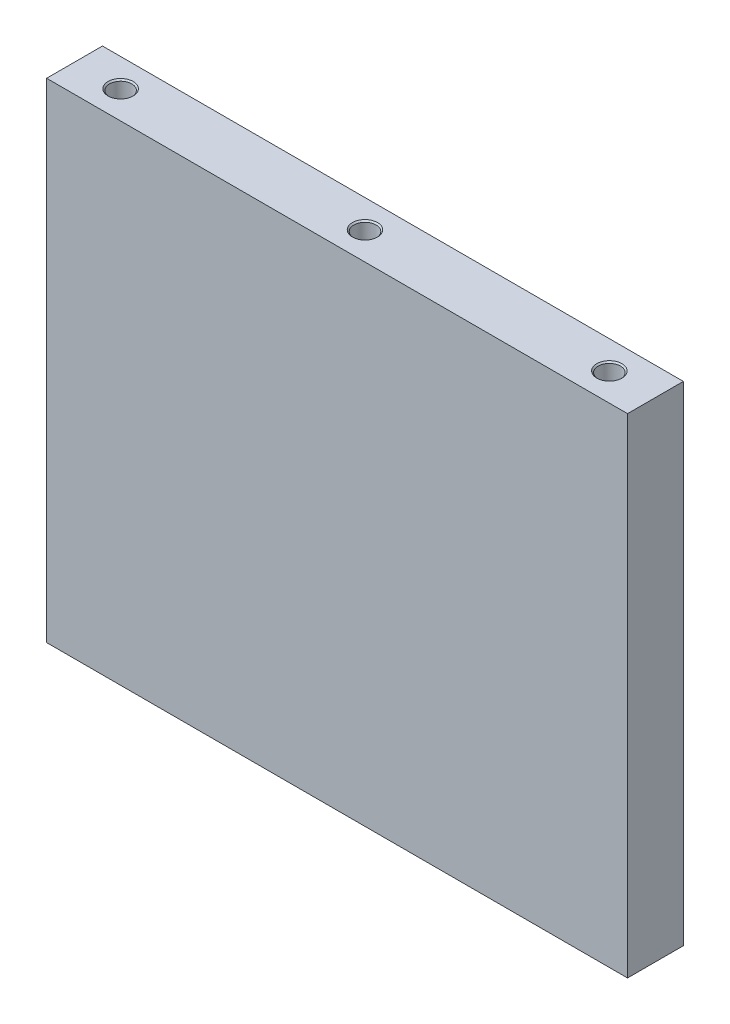
ISO-10303-21;
HEADER;
FILE_DESCRIPTION(('STEP AP214'),'2;1');
FILE_NAME('part.step','',(''),(''),'','','');
FILE_SCHEMA(('AUTOMOTIVE_DESIGN { 1 0 10303 214 1 1 1 1 }'));
ENDSEC;
DATA;
#1=APPLICATION_CONTEXT('core data for automotive mechanical design processes');
#2=APPLICATION_PROTOCOL_DEFINITION('international standard','automotive_design',2000,#1);
#3=PRODUCT_CONTEXT('',#1,'mechanical');
#4=PRODUCT('Part','Part','',(#3));
#5=PRODUCT_RELATED_PRODUCT_CATEGORY('part','',(#4));
#6=PRODUCT_DEFINITION_FORMATION('','',#4);
#7=PRODUCT_DEFINITION_CONTEXT('part definition',#1,'design');
#8=PRODUCT_DEFINITION('design','',#6,#7);
#9=PRODUCT_DEFINITION_SHAPE('','',#8);
#10=(LENGTH_UNIT() NAMED_UNIT(*) SI_UNIT(.MILLI.,.METRE.));
#11=(NAMED_UNIT(*) PLANE_ANGLE_UNIT() SI_UNIT($,.RADIAN.));
#12=(NAMED_UNIT(*) SI_UNIT($,.STERADIAN.) SOLID_ANGLE_UNIT());
#13=UNCERTAINTY_MEASURE_WITH_UNIT(LENGTH_MEASURE(1.E-05),#10,'distance_accuracy_value','');
#14=(GEOMETRIC_REPRESENTATION_CONTEXT(3) GLOBAL_UNCERTAINTY_ASSIGNED_CONTEXT((#13)) GLOBAL_UNIT_ASSIGNED_CONTEXT((#10,
#11,#12)) REPRESENTATION_CONTEXT('',''));
#15=CARTESIAN_POINT('',(0.,0.,0.));
#16=DIRECTION('',(0.,0.,1.));
#17=DIRECTION('',(1.,0.,0.));
#18=AXIS2_PLACEMENT_3D('',#15,#16,#17);
#19=CARTESIAN_POINT('',(-104.,175.,9.99999999999998));
#20=DIRECTION('',(1.,0.,0.));
#21=DIRECTION('',(0.,0.,-1.));
#22=AXIS2_PLACEMENT_3D('',#19,#20,#21);
#23=PLANE('',#22);
#24=DIRECTION('',(0.,0.,1.));
#25=VECTOR('',#24,1.);
#26=CARTESIAN_POINT('',(-104.,0.,9.99999999999998));
#27=LINE('',#26,#25);
#28=CARTESIAN_POINT('',(-104.,0.,-9.99999999999999));
#29=VERTEX_POINT('',#28);
#30=CARTESIAN_POINT('',(-104.,0.,9.99999999999998));
#31=VERTEX_POINT('',#30);
#32=EDGE_CURVE('E111',#29,#31,#27,.T.);
#33=ORIENTED_EDGE('',*,*,#32,.T.);
#34=DIRECTION('',(0.,-1.,0.));
#35=VECTOR('',#34,1.);
#36=CARTESIAN_POINT('',(-104.,175.,9.99999999999998));
#37=LINE('',#36,#35);
#38=CARTESIAN_POINT('',(-104.,175.,9.99999999999998));
#39=VERTEX_POINT('',#38);
#40=EDGE_CURVE('E98',#39,#31,#37,.T.);
#41=ORIENTED_EDGE('',*,*,#40,.F.);
#42=DIRECTION('',(0.,0.,1.));
#43=VECTOR('',#42,1.);
#44=CARTESIAN_POINT('',(-104.,175.,9.99999999999998));
#45=LINE('',#44,#43);
#46=CARTESIAN_POINT('',(-104.,175.,-9.99999999999999));
#47=VERTEX_POINT('',#46);
#48=EDGE_CURVE('E90',#47,#39,#45,.T.);
#49=ORIENTED_EDGE('',*,*,#48,.F.);
#50=DIRECTION('',(0.,-1.,0.));
#51=VECTOR('',#50,1.);
#52=CARTESIAN_POINT('',(-104.,175.,-9.99999999999999));
#53=LINE('',#52,#51);
#54=EDGE_CURVE('E107',#47,#29,#53,.T.);
#55=ORIENTED_EDGE('',*,*,#54,.T.);
#56=EDGE_LOOP('',(#33,#41,#49,#55));
#57=FACE_BOUND('',#56,.T.);
#58=ADVANCED_FACE('F36',(#57),#23,.F.);
#59=CARTESIAN_POINT('',(-104.,175.,9.99999999999998));
#60=DIRECTION('',(0.,0.,-1.));
#61=DIRECTION('',(-1.,0.,0.));
#62=AXIS2_PLACEMENT_3D('',#59,#60,#61);
#63=PLANE('',#62);
#64=DIRECTION('',(1.,0.,0.));
#65=VECTOR('',#64,1.);
#66=CARTESIAN_POINT('',(-104.,0.,9.99999999999998));
#67=LINE('',#66,#65);
#68=CARTESIAN_POINT('',(104.,0.,10.));
#69=VERTEX_POINT('',#68);
#70=EDGE_CURVE('E96',#31,#69,#67,.T.);
#71=ORIENTED_EDGE('',*,*,#70,.T.);
#72=DIRECTION('',(0.,-1.,0.));
#73=VECTOR('',#72,1.);
#74=CARTESIAN_POINT('',(104.,175.,10.));
#75=LINE('',#74,#73);
#76=CARTESIAN_POINT('',(104.,175.,10.));
#77=VERTEX_POINT('',#76);
#78=EDGE_CURVE('E94',#77,#69,#75,.T.);
#79=ORIENTED_EDGE('',*,*,#78,.F.);
#80=DIRECTION('',(1.,0.,0.));
#81=VECTOR('',#80,1.);
#82=CARTESIAN_POINT('',(-104.,175.,9.99999999999998));
#83=LINE('',#82,#81);
#84=EDGE_CURVE('E85',#39,#77,#83,.T.);
#85=ORIENTED_EDGE('',*,*,#84,.F.);
#86=ORIENTED_EDGE('',*,*,#40,.T.);
#87=EDGE_LOOP('',(#71,#79,#85,#86));
#88=FACE_BOUND('',#87,.T.);
#89=ADVANCED_FACE('F95',(#88),#63,.F.);
#90=CARTESIAN_POINT('',(104.,175.,10.));
#91=DIRECTION('',(-1.,0.,0.));
#92=DIRECTION('',(0.,0.,1.));
#93=AXIS2_PLACEMENT_3D('',#90,#91,#92);
#94=PLANE('',#93);
#95=DIRECTION('',(0.,0.,-1.));
#96=VECTOR('',#95,1.);
#97=CARTESIAN_POINT('',(104.,0.,10.));
#98=LINE('',#97,#96);
#99=CARTESIAN_POINT('',(104.,0.,-9.99999999999999));
#100=VERTEX_POINT('',#99);
#101=EDGE_CURVE('E71',#69,#100,#98,.T.);
#102=ORIENTED_EDGE('',*,*,#101,.T.);
#103=DIRECTION('',(0.,-1.,0.));
#104=VECTOR('',#103,1.);
#105=CARTESIAN_POINT('',(104.,175.,-9.99999999999999));
#106=LINE('',#105,#104);
#107=CARTESIAN_POINT('',(104.,175.,-9.99999999999999));
#108=VERTEX_POINT('',#107);
#109=EDGE_CURVE('E99',#108,#100,#106,.T.);
#110=ORIENTED_EDGE('',*,*,#109,.F.);
#111=DIRECTION('',(0.,0.,-1.));
#112=VECTOR('',#111,1.);
#113=CARTESIAN_POINT('',(104.,175.,10.));
#114=LINE('',#113,#112);
#115=EDGE_CURVE('E88',#77,#108,#114,.T.);
#116=ORIENTED_EDGE('',*,*,#115,.F.);
#117=ORIENTED_EDGE('',*,*,#78,.T.);
#118=EDGE_LOOP('',(#102,#110,#116,#117));
#119=FACE_BOUND('',#118,.T.);
#120=ADVANCED_FACE('F101',(#119),#94,.F.);
#121=CARTESIAN_POINT('',(-104.,175.,-9.99999999999999));
#122=DIRECTION('',(0.,0.,1.));
#123=DIRECTION('',(1.,0.,0.));
#124=AXIS2_PLACEMENT_3D('',#121,#122,#123);
#125=PLANE('',#124);
#126=DIRECTION('',(-1.,0.,0.));
#127=VECTOR('',#126,1.);
#128=CARTESIAN_POINT('',(-104.,0.,-9.99999999999999));
#129=LINE('',#128,#127);
#130=EDGE_CURVE('E77',#100,#29,#129,.T.);
#131=ORIENTED_EDGE('',*,*,#130,.T.);
#132=ORIENTED_EDGE('',*,*,#54,.F.);
#133=DIRECTION('',(-1.,0.,0.));
#134=VECTOR('',#133,1.);
#135=CARTESIAN_POINT('',(-104.,175.,-9.99999999999999));
#136=LINE('',#135,#134);
#137=EDGE_CURVE('E54',#108,#47,#136,.T.);
#138=ORIENTED_EDGE('',*,*,#137,.F.);
#139=ORIENTED_EDGE('',*,*,#109,.T.);
#140=EDGE_LOOP('',(#131,#132,#138,#139));
#141=FACE_BOUND('',#140,.T.);
#142=ADVANCED_FACE('F217',(#141),#125,.F.);
#143=CARTESIAN_POINT('',(0.,175.,0.));
#144=DIRECTION('',(0.,-1.,0.));
#145=DIRECTION('',(0.,0.,-1.));
#146=AXIS2_PLACEMENT_3D('',#143,#144,#145);
#147=PLANE('',#146);
#148=CARTESIAN_POINT('',(87.5,175.,0.));
#149=DIRECTION('',(0.,-1.,0.));
#150=DIRECTION('',(0.,0.,-1.));
#151=AXIS2_PLACEMENT_3D('',#148,#149,#150);
#152=CIRCLE('',#151,4.50000000000003);
#153=CARTESIAN_POINT('',(87.5,175.,-4.50000000000005));
#154=VERTEX_POINT('',#153);
#155=EDGE_CURVE('E163',#154,#154,#152,.T.);
#156=ORIENTED_EDGE('',*,*,#155,.T.);
#157=EDGE_LOOP('',(#156));
#158=FACE_BOUND('',#157,.T.);
#159=CARTESIAN_POINT('',(0.,175.,0.));
#160=DIRECTION('',(0.,-1.,0.));
#161=DIRECTION('',(0.,0.,-1.));
#162=AXIS2_PLACEMENT_3D('',#159,#160,#161);
#163=CIRCLE('',#162,4.50000000000003);
#164=CARTESIAN_POINT('',(0.,175.,-4.50000000000003));
#165=VERTEX_POINT('',#164);
#166=EDGE_CURVE('E159',#165,#165,#163,.T.);
#167=ORIENTED_EDGE('',*,*,#166,.T.);
#168=EDGE_LOOP('',(#167));
#169=FACE_BOUND('',#168,.T.);
#170=CARTESIAN_POINT('',(-87.5,175.,0.));
#171=DIRECTION('',(0.,-1.,0.));
#172=DIRECTION('',(0.,0.,-1.));
#173=AXIS2_PLACEMENT_3D('',#170,#171,#172);
#174=CIRCLE('',#173,4.50000000000003);
#175=CARTESIAN_POINT('',(-87.5,175.,-4.50000000000003));
#176=VERTEX_POINT('',#175);
#177=EDGE_CURVE('E155',#176,#176,#174,.T.);
#178=ORIENTED_EDGE('',*,*,#177,.T.);
#179=EDGE_LOOP('',(#178));
#180=FACE_BOUND('',#179,.T.);
#181=ORIENTED_EDGE('',*,*,#48,.T.);
#182=ORIENTED_EDGE('',*,*,#84,.T.);
#183=ORIENTED_EDGE('',*,*,#115,.T.);
#184=ORIENTED_EDGE('',*,*,#137,.T.);
#185=EDGE_LOOP('',(#181,#182,#183,#184));
#186=FACE_BOUND('',#185,.T.);
#187=ADVANCED_FACE('F86',(#158,#169,#180,#186),#147,.F.);
#188=CARTESIAN_POINT('',(0.,0.,0.));
#189=DIRECTION('',(0.,-1.,0.));
#190=DIRECTION('',(0.,0.,-1.));
#191=AXIS2_PLACEMENT_3D('',#188,#189,#190);
#192=PLANE('',#191);
#193=CARTESIAN_POINT('',(-87.5,0.,0.));
#194=DIRECTION('',(0.,-1.,0.));
#195=DIRECTION('',(0.,0.,-1.));
#196=AXIS2_PLACEMENT_3D('',#193,#194,#195);
#197=CIRCLE('',#196,4.49999999999998);
#198=CARTESIAN_POINT('',(-87.5,0.,-4.49999999999998));
#199=VERTEX_POINT('',#198);
#200=EDGE_CURVE('E135',#199,#199,#197,.F.);
#201=ORIENTED_EDGE('',*,*,#200,.T.);
#202=EDGE_LOOP('',(#201));
#203=FACE_BOUND('',#202,.T.);
#204=CARTESIAN_POINT('',(0.,0.,0.));
#205=DIRECTION('',(0.,-1.,0.));
#206=DIRECTION('',(0.,0.,-1.));
#207=AXIS2_PLACEMENT_3D('',#204,#205,#206);
#208=CIRCLE('',#207,4.49999999999998);
#209=CARTESIAN_POINT('',(0.,0.,-4.49999999999998));
#210=VERTEX_POINT('',#209);
#211=EDGE_CURVE('E131',#210,#210,#208,.F.);
#212=ORIENTED_EDGE('',*,*,#211,.T.);
#213=EDGE_LOOP('',(#212));
#214=FACE_BOUND('',#213,.T.);
#215=CARTESIAN_POINT('',(87.5,0.,0.));
#216=DIRECTION('',(0.,-1.,0.));
#217=DIRECTION('',(0.,0.,-1.));
#218=AXIS2_PLACEMENT_3D('',#215,#216,#217);
#219=CIRCLE('',#218,4.49999999999998);
#220=CARTESIAN_POINT('',(87.5,0.,-4.5));
#221=VERTEX_POINT('',#220);
#222=EDGE_CURVE('E127',#221,#221,#219,.F.);
#223=ORIENTED_EDGE('',*,*,#222,.T.);
#224=EDGE_LOOP('',(#223));
#225=FACE_BOUND('',#224,.T.);
#226=ORIENTED_EDGE('',*,*,#32,.F.);
#227=ORIENTED_EDGE('',*,*,#130,.F.);
#228=ORIENTED_EDGE('',*,*,#101,.F.);
#229=ORIENTED_EDGE('',*,*,#70,.F.);
#230=EDGE_LOOP('',(#226,#227,#228,#229));
#231=FACE_BOUND('',#230,.T.);
#232=ADVANCED_FACE('F211',(#203,#214,#225,#231),#192,.T.);
#233=CARTESIAN_POINT('',(0.,163.,0.));
#234=DIRECTION('',(0.,1.,0.));
#235=DIRECTION('',(0.,0.,1.));
#236=AXIS2_PLACEMENT_3D('',#233,#234,#235);
#237=CYLINDRICAL_SURFACE('',#236,4.);
#238=CARTESIAN_POINT('',(0.,174.5,0.));
#239=DIRECTION('',(0.,-1.,0.));
#240=DIRECTION('',(0.,0.,-1.));
#241=AXIS2_PLACEMENT_3D('',#238,#239,#240);
#242=CIRCLE('',#241,4.);
#243=CARTESIAN_POINT('',(0.,174.5,-4.));
#244=VERTEX_POINT('',#243);
#245=EDGE_CURVE('E46',#244,#244,#242,.F.);
#246=ORIENTED_EDGE('',*,*,#245,.T.);
#247=EDGE_LOOP('',(#246));
#248=FACE_BOUND('',#247,.T.);
#249=CARTESIAN_POINT('',(0.,163.,0.));
#250=DIRECTION('',(0.,1.,0.));
#251=DIRECTION('',(0.,0.,1.));
#252=AXIS2_PLACEMENT_3D('',#249,#250,#251);
#253=CIRCLE('',#252,4.);
#254=CARTESIAN_POINT('',(0.,163.,4.));
#255=VERTEX_POINT('',#254);
#256=EDGE_CURVE('E115',#255,#255,#253,.T.);
#257=ORIENTED_EDGE('',*,*,#256,.F.);
#258=EDGE_LOOP('',(#257));
#259=FACE_BOUND('',#258,.T.);
#260=ADVANCED_FACE('F169',(#248,#259),#237,.F.);
#261=CARTESIAN_POINT('',(0.,163.,0.));
#262=DIRECTION('',(0.,1.,0.));
#263=DIRECTION('',(0.,0.,1.));
#264=AXIS2_PLACEMENT_3D('',#261,#262,#263);
#265=PLANE('',#264);
#266=ORIENTED_EDGE('',*,*,#256,.T.);
#267=EDGE_LOOP('',(#266));
#268=FACE_BOUND('',#267,.T.);
#269=ADVANCED_FACE('F229',(#268),#265,.T.);
#270=CARTESIAN_POINT('',(-87.5,163.,0.));
#271=DIRECTION('',(0.,1.,0.));
#272=DIRECTION('',(0.,0.,1.));
#273=AXIS2_PLACEMENT_3D('',#270,#271,#272);
#274=CYLINDRICAL_SURFACE('',#273,4.00000000000001);
#275=CARTESIAN_POINT('',(-87.5,174.5,0.));
#276=DIRECTION('',(0.,-1.,0.));
#277=DIRECTION('',(0.,0.,-1.));
#278=AXIS2_PLACEMENT_3D('',#275,#276,#277);
#279=CIRCLE('',#278,4.00000000000001);
#280=CARTESIAN_POINT('',(-87.5,174.5,-4.00000000000001));
#281=VERTEX_POINT('',#280);
#282=EDGE_CURVE('E11',#281,#281,#279,.F.);
#283=ORIENTED_EDGE('',*,*,#282,.T.);
#284=EDGE_LOOP('',(#283));
#285=FACE_BOUND('',#284,.T.);
#286=CARTESIAN_POINT('',(-87.5,163.,0.));
#287=DIRECTION('',(0.,1.,0.));
#288=DIRECTION('',(0.,0.,1.));
#289=AXIS2_PLACEMENT_3D('',#286,#287,#288);
#290=CIRCLE('',#289,4.00000000000001);
#291=CARTESIAN_POINT('',(-87.5,163.,4.00000000000001));
#292=VERTEX_POINT('',#291);
#293=EDGE_CURVE('E290',#292,#292,#290,.T.);
#294=ORIENTED_EDGE('',*,*,#293,.F.);
#295=EDGE_LOOP('',(#294));
#296=FACE_BOUND('',#295,.T.);
#297=ADVANCED_FACE('F232',(#285,#296),#274,.F.);
#298=CARTESIAN_POINT('',(-87.5,163.,0.));
#299=DIRECTION('',(0.,1.,0.));
#300=DIRECTION('',(0.,0.,1.));
#301=AXIS2_PLACEMENT_3D('',#298,#299,#300);
#302=PLANE('',#301);
#303=ORIENTED_EDGE('',*,*,#293,.T.);
#304=EDGE_LOOP('',(#303));
#305=FACE_BOUND('',#304,.T.);
#306=ADVANCED_FACE('F238',(#305),#302,.T.);
#307=CARTESIAN_POINT('',(87.5,163.,0.));
#308=DIRECTION('',(0.,1.,0.));
#309=DIRECTION('',(0.,0.,1.));
#310=AXIS2_PLACEMENT_3D('',#307,#308,#309);
#311=CYLINDRICAL_SURFACE('',#310,4.00000000000001);
#312=CARTESIAN_POINT('',(87.5,174.5,0.));
#313=DIRECTION('',(0.,-1.,0.));
#314=DIRECTION('',(0.,0.,-1.));
#315=AXIS2_PLACEMENT_3D('',#312,#313,#314);
#316=CIRCLE('',#315,4.00000000000001);
#317=CARTESIAN_POINT('',(87.5,174.5,-4.00000000000003));
#318=VERTEX_POINT('',#317);
#319=EDGE_CURVE('E151',#318,#318,#316,.F.);
#320=ORIENTED_EDGE('',*,*,#319,.T.);
#321=EDGE_LOOP('',(#320));
#322=FACE_BOUND('',#321,.T.);
#323=CARTESIAN_POINT('',(87.5,163.,0.));
#324=DIRECTION('',(0.,1.,0.));
#325=DIRECTION('',(0.,0.,-1.));
#326=AXIS2_PLACEMENT_3D('',#323,#324,#325);
#327=CIRCLE('',#326,4.00000000000001);
#328=CARTESIAN_POINT('',(87.5,163.,-4.00000000000003));
#329=VERTEX_POINT('',#328);
#330=EDGE_CURVE('E284',#329,#329,#327,.T.);
#331=ORIENTED_EDGE('',*,*,#330,.F.);
#332=EDGE_LOOP('',(#331));
#333=FACE_BOUND('',#332,.T.);
#334=ADVANCED_FACE('F234',(#322,#333),#311,.F.);
#335=CARTESIAN_POINT('',(87.5,163.,0.));
#336=DIRECTION('',(0.,-1.,0.));
#337=DIRECTION('',(0.,0.,-1.));
#338=AXIS2_PLACEMENT_3D('',#335,#336,#337);
#339=PLANE('',#338);
#340=ORIENTED_EDGE('',*,*,#330,.T.);
#341=EDGE_LOOP('',(#340));
#342=FACE_BOUND('',#341,.T.);
#343=ADVANCED_FACE('F237',(#342),#339,.F.);
#344=CARTESIAN_POINT('',(0.,12.,0.));
#345=DIRECTION('',(0.,-1.,0.));
#346=DIRECTION('',(0.,0.,-1.));
#347=AXIS2_PLACEMENT_3D('',#344,#345,#346);
#348=CYLINDRICAL_SURFACE('',#347,4.);
#349=CARTESIAN_POINT('',(0.,0.49999999999999,0.));
#350=DIRECTION('',(0.,-1.,0.));
#351=DIRECTION('',(0.,0.,-1.));
#352=AXIS2_PLACEMENT_3D('',#349,#350,#351);
#353=CIRCLE('',#352,4.);
#354=CARTESIAN_POINT('',(0.,0.49999999999999,-4.));
#355=VERTEX_POINT('',#354);
#356=EDGE_CURVE('E143',#355,#355,#353,.T.);
#357=ORIENTED_EDGE('',*,*,#356,.T.);
#358=EDGE_LOOP('',(#357));
#359=FACE_BOUND('',#358,.T.);
#360=CARTESIAN_POINT('',(0.,12.,0.));
#361=DIRECTION('',(0.,1.,0.));
#362=DIRECTION('',(0.,0.,1.));
#363=AXIS2_PLACEMENT_3D('',#360,#361,#362);
#364=CIRCLE('',#363,4.);
#365=CARTESIAN_POINT('',(0.,12.,4.));
#366=VERTEX_POINT('',#365);
#367=EDGE_CURVE('E278',#366,#366,#364,.T.);
#368=ORIENTED_EDGE('',*,*,#367,.T.);
#369=EDGE_LOOP('',(#368));
#370=FACE_BOUND('',#369,.T.);
#371=ADVANCED_FACE('F242',(#359,#370),#348,.F.);
#372=CARTESIAN_POINT('',(0.,12.,0.));
#373=DIRECTION('',(0.,-1.,0.));
#374=DIRECTION('',(0.,0.,1.));
#375=AXIS2_PLACEMENT_3D('',#372,#373,#374);
#376=PLANE('',#375);
#377=ORIENTED_EDGE('',*,*,#367,.F.);
#378=EDGE_LOOP('',(#377));
#379=FACE_BOUND('',#378,.T.);
#380=ADVANCED_FACE('F252',(#379),#376,.T.);
#381=CARTESIAN_POINT('',(-87.5,12.,0.));
#382=DIRECTION('',(0.,-1.,0.));
#383=DIRECTION('',(0.,0.,-1.));
#384=AXIS2_PLACEMENT_3D('',#381,#382,#383);
#385=CYLINDRICAL_SURFACE('',#384,4.00000000000001);
#386=CARTESIAN_POINT('',(-87.5,0.499999999999983,0.));
#387=DIRECTION('',(0.,-1.,0.));
#388=DIRECTION('',(0.,0.,-1.));
#389=AXIS2_PLACEMENT_3D('',#386,#387,#388);
#390=CIRCLE('',#389,4.00000000000001);
#391=CARTESIAN_POINT('',(-87.5,0.499999999999983,-4.00000000000001));
#392=VERTEX_POINT('',#391);
#393=EDGE_CURVE('E139',#392,#392,#390,.T.);
#394=ORIENTED_EDGE('',*,*,#393,.T.);
#395=EDGE_LOOP('',(#394));
#396=FACE_BOUND('',#395,.T.);
#397=CARTESIAN_POINT('',(-87.5,12.,0.));
#398=DIRECTION('',(0.,1.,0.));
#399=DIRECTION('',(0.,0.,1.));
#400=AXIS2_PLACEMENT_3D('',#397,#398,#399);
#401=CIRCLE('',#400,4.00000000000001);
#402=CARTESIAN_POINT('',(-87.5,12.,4.00000000000001));
#403=VERTEX_POINT('',#402);
#404=EDGE_CURVE('E275',#403,#403,#401,.T.);
#405=ORIENTED_EDGE('',*,*,#404,.T.);
#406=EDGE_LOOP('',(#405));
#407=FACE_BOUND('',#406,.T.);
#408=ADVANCED_FACE('F256',(#396,#407),#385,.F.);
#409=CARTESIAN_POINT('',(-87.5,12.,0.));
#410=DIRECTION('',(0.,-1.,0.));
#411=DIRECTION('',(0.,0.,1.));
#412=AXIS2_PLACEMENT_3D('',#409,#410,#411);
#413=PLANE('',#412);
#414=ORIENTED_EDGE('',*,*,#404,.F.);
#415=EDGE_LOOP('',(#414));
#416=FACE_BOUND('',#415,.T.);
#417=ADVANCED_FACE('F261',(#416),#413,.T.);
#418=CARTESIAN_POINT('',(87.5,12.,0.));
#419=DIRECTION('',(0.,-1.,0.));
#420=DIRECTION('',(0.,0.,-1.));
#421=AXIS2_PLACEMENT_3D('',#418,#419,#420);
#422=CYLINDRICAL_SURFACE('',#421,4.00000000000001);
#423=CARTESIAN_POINT('',(87.5,0.499999999999983,0.));
#424=DIRECTION('',(0.,-1.,0.));
#425=DIRECTION('',(0.,0.,-1.));
#426=AXIS2_PLACEMENT_3D('',#423,#424,#425);
#427=CIRCLE('',#426,4.00000000000001);
#428=CARTESIAN_POINT('',(87.5,0.499999999999983,-4.00000000000003));
#429=VERTEX_POINT('',#428);
#430=EDGE_CURVE('E147',#429,#429,#427,.T.);
#431=ORIENTED_EDGE('',*,*,#430,.T.);
#432=EDGE_LOOP('',(#431));
#433=FACE_BOUND('',#432,.T.);
#434=CARTESIAN_POINT('',(87.5,12.,0.));
#435=DIRECTION('',(0.,1.,0.));
#436=DIRECTION('',(0.,0.,-1.));
#437=AXIS2_PLACEMENT_3D('',#434,#435,#436);
#438=CIRCLE('',#437,4.00000000000001);
#439=CARTESIAN_POINT('',(87.5,12.,-4.00000000000003));
#440=VERTEX_POINT('',#439);
#441=EDGE_CURVE('E279',#440,#440,#438,.T.);
#442=ORIENTED_EDGE('',*,*,#441,.T.);
#443=EDGE_LOOP('',(#442));
#444=FACE_BOUND('',#443,.T.);
#445=ADVANCED_FACE('F258',(#433,#444),#422,.F.);
#446=CARTESIAN_POINT('',(87.5,12.,0.));
#447=DIRECTION('',(0.,1.,0.));
#448=DIRECTION('',(0.,0.,-1.));
#449=AXIS2_PLACEMENT_3D('',#446,#447,#448);
#450=PLANE('',#449);
#451=ORIENTED_EDGE('',*,*,#441,.F.);
#452=EDGE_LOOP('',(#451));
#453=FACE_BOUND('',#452,.T.);
#454=ADVANCED_FACE('F198',(#453),#450,.F.);
#455=CARTESIAN_POINT('',(-87.5,0.,0.));
#456=DIRECTION('',(0.,-1.,0.));
#457=DIRECTION('',(0.,0.,-1.));
#458=AXIS2_PLACEMENT_3D('',#455,#456,#457);
#459=CONICAL_SURFACE('',#458,4.49999999999998,0.785398163397435);
#460=ORIENTED_EDGE('',*,*,#393,.F.);
#461=EDGE_LOOP('',(#460));
#462=FACE_BOUND('',#461,.T.);
#463=ORIENTED_EDGE('',*,*,#200,.F.);
#464=EDGE_LOOP('',(#463));
#465=FACE_BOUND('',#464,.T.);
#466=ADVANCED_FACE('F194',(#462,#465),#459,.F.);
#467=CARTESIAN_POINT('',(0.,0.,0.));
#468=DIRECTION('',(0.,-1.,0.));
#469=DIRECTION('',(0.,0.,-1.));
#470=AXIS2_PLACEMENT_3D('',#467,#468,#469);
#471=CONICAL_SURFACE('',#470,4.49999999999998,0.785398163397434);
#472=ORIENTED_EDGE('',*,*,#356,.F.);
#473=EDGE_LOOP('',(#472));
#474=FACE_BOUND('',#473,.T.);
#475=ORIENTED_EDGE('',*,*,#211,.F.);
#476=EDGE_LOOP('',(#475));
#477=FACE_BOUND('',#476,.T.);
#478=ADVANCED_FACE('F197',(#474,#477),#471,.F.);
#479=CARTESIAN_POINT('',(87.5,0.,0.));
#480=DIRECTION('',(0.,-1.,0.));
#481=DIRECTION('',(0.,0.,-1.));
#482=AXIS2_PLACEMENT_3D('',#479,#480,#481);
#483=CONICAL_SURFACE('',#482,4.49999999999998,0.785398163397435);
#484=ORIENTED_EDGE('',*,*,#430,.F.);
#485=EDGE_LOOP('',(#484));
#486=FACE_BOUND('',#485,.T.);
#487=ORIENTED_EDGE('',*,*,#222,.F.);
#488=EDGE_LOOP('',(#487));
#489=FACE_BOUND('',#488,.T.);
#490=ADVANCED_FACE('F181',(#486,#489),#483,.F.);
#491=CARTESIAN_POINT('',(87.5,174.5,0.));
#492=DIRECTION('',(0.,1.,0.));
#493=DIRECTION('',(0.,0.,1.));
#494=AXIS2_PLACEMENT_3D('',#491,#492,#493);
#495=CONICAL_SURFACE('',#494,4.00000000000001,0.785398163397473);
#496=ORIENTED_EDGE('',*,*,#155,.F.);
#497=EDGE_LOOP('',(#496));
#498=FACE_BOUND('',#497,.T.);
#499=ORIENTED_EDGE('',*,*,#319,.F.);
#500=EDGE_LOOP('',(#499));
#501=FACE_BOUND('',#500,.T.);
#502=ADVANCED_FACE('F174',(#498,#501),#495,.F.);
#503=CARTESIAN_POINT('',(0.,174.5,0.));
#504=DIRECTION('',(0.,1.,0.));
#505=DIRECTION('',(0.,0.,1.));
#506=AXIS2_PLACEMENT_3D('',#503,#504,#505);
#507=CONICAL_SURFACE('',#506,4.,0.785398163397452);
#508=ORIENTED_EDGE('',*,*,#166,.F.);
#509=EDGE_LOOP('',(#508));
#510=FACE_BOUND('',#509,.T.);
#511=ORIENTED_EDGE('',*,*,#245,.F.);
#512=EDGE_LOOP('',(#511));
#513=FACE_BOUND('',#512,.T.);
#514=ADVANCED_FACE('F172',(#510,#513),#507,.F.);
#515=CARTESIAN_POINT('',(-87.5,174.5,0.));
#516=DIRECTION('',(0.,1.,0.));
#517=DIRECTION('',(0.,0.,1.));
#518=AXIS2_PLACEMENT_3D('',#515,#516,#517);
#519=CONICAL_SURFACE('',#518,4.00000000000001,0.785398163397473);
#520=ORIENTED_EDGE('',*,*,#177,.F.);
#521=EDGE_LOOP('',(#520));
#522=FACE_BOUND('',#521,.T.);
#523=ORIENTED_EDGE('',*,*,#282,.F.);
#524=EDGE_LOOP('',(#523));
#525=FACE_BOUND('',#524,.T.);
#526=ADVANCED_FACE('F38',(#522,#525),#519,.F.);
#527=CLOSED_SHELL('',(#58,#89,#120,#142,#187,#232,#260,#269,#297,#306,#334,#343,#371,#380,#408,
#417,#445,#454,#466,#478,#490,#502,#514,#526));
#528=MANIFOLD_SOLID_BREP('B2',#527);
#529=ADVANCED_BREP_SHAPE_REPRESENTATION('',(#18,#528),#14);
#530=SHAPE_DEFINITION_REPRESENTATION(#9,#529);
ENDSEC;
END-ISO-10303-21;
